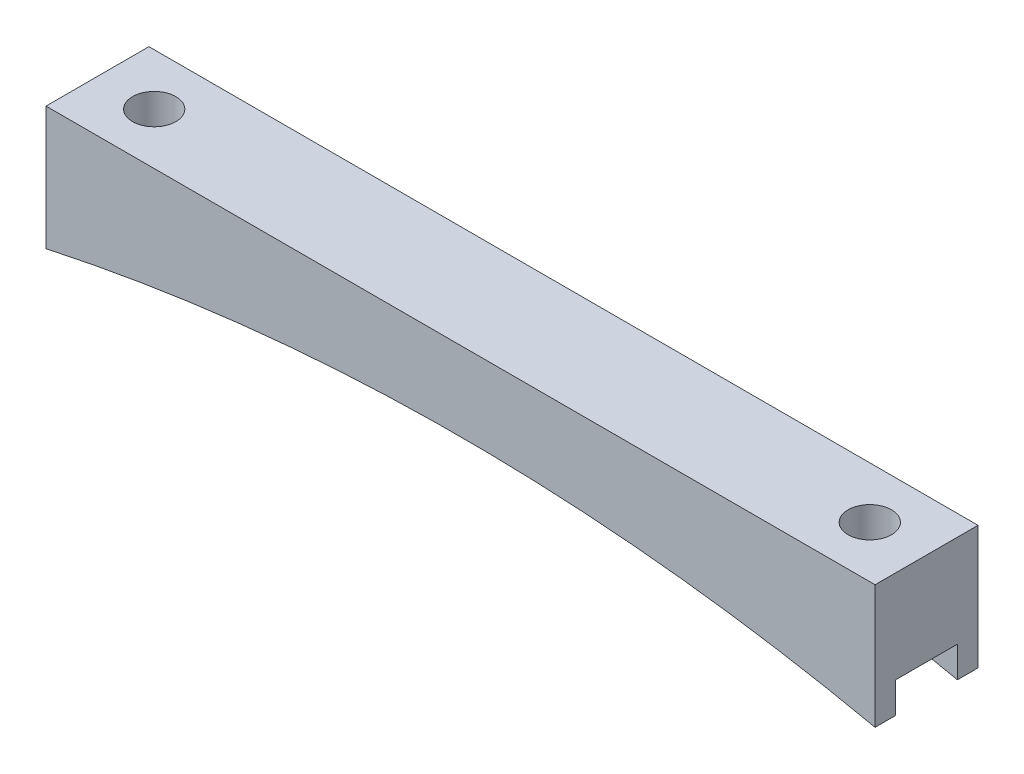
ISO-10303-21;
HEADER;
FILE_DESCRIPTION(('STEP AP214'),'2;1');
FILE_NAME('part.step','',(''),(''),'','','');
FILE_SCHEMA(('AUTOMOTIVE_DESIGN { 1 0 10303 214 1 1 1 1 }'));
ENDSEC;
DATA;
#1=APPLICATION_CONTEXT('core data for automotive mechanical design processes');
#2=APPLICATION_PROTOCOL_DEFINITION('international standard','automotive_design',2000,#1);
#3=PRODUCT_CONTEXT('',#1,'mechanical');
#4=PRODUCT('Part','Part','',(#3));
#5=PRODUCT_RELATED_PRODUCT_CATEGORY('part','',(#4));
#6=PRODUCT_DEFINITION_FORMATION('','',#4);
#7=PRODUCT_DEFINITION_CONTEXT('part definition',#1,'design');
#8=PRODUCT_DEFINITION('design','',#6,#7);
#9=PRODUCT_DEFINITION_SHAPE('','',#8);
#10=(LENGTH_UNIT() NAMED_UNIT(*) SI_UNIT(.MILLI.,.METRE.));
#11=(NAMED_UNIT(*) PLANE_ANGLE_UNIT() SI_UNIT($,.RADIAN.));
#12=(NAMED_UNIT(*) SI_UNIT($,.STERADIAN.) SOLID_ANGLE_UNIT());
#13=UNCERTAINTY_MEASURE_WITH_UNIT(LENGTH_MEASURE(1.E-05),#10,'distance_accuracy_value','');
#14=(GEOMETRIC_REPRESENTATION_CONTEXT(3) GLOBAL_UNCERTAINTY_ASSIGNED_CONTEXT((#13)) GLOBAL_UNIT_ASSIGNED_CONTEXT((#10,
#11,#12)) REPRESENTATION_CONTEXT('',''));
#15=CARTESIAN_POINT('',(0.,0.,0.));
#16=DIRECTION('',(0.,0.,1.));
#17=DIRECTION('',(1.,0.,0.));
#18=AXIS2_PLACEMENT_3D('',#15,#16,#17);
#19=CARTESIAN_POINT('',(51.145,0.,12.7));
#20=DIRECTION('',(-1.,0.,0.));
#21=DIRECTION('',(0.,-1.,0.));
#22=AXIS2_PLACEMENT_3D('',#19,#20,#21);
#23=PLANE('',#22);
#24=DIRECTION('',(0.,0.,-1.));
#25=VECTOR('',#24,1.);
#26=CARTESIAN_POINT('',(51.145,-15.24,12.7));
#27=LINE('',#26,#25);
#28=CARTESIAN_POINT('',(51.145,-15.24,12.7));
#29=VERTEX_POINT('',#28);
#30=CARTESIAN_POINT('',(51.145,-15.24,10.16));
#31=VERTEX_POINT('',#30);
#32=EDGE_CURVE('E156',#29,#31,#27,.T.);
#33=ORIENTED_EDGE('',*,*,#32,.T.);
#34=DIRECTION('',(0.,-1.,0.));
#35=VECTOR('',#34,1.);
#36=CARTESIAN_POINT('',(51.145,-15.24,10.16));
#37=LINE('',#36,#35);
#38=CARTESIAN_POINT('',(51.145,-11.43,10.16));
#39=VERTEX_POINT('',#38);
#40=EDGE_CURVE('E185',#39,#31,#37,.T.);
#41=ORIENTED_EDGE('',*,*,#40,.F.);
#42=DIRECTION('',(0.,0.,1.));
#43=VECTOR('',#42,1.);
#44=CARTESIAN_POINT('',(51.145,-11.43,10.16));
#45=LINE('',#44,#43);
#46=CARTESIAN_POINT('',(51.145,-11.43,2.54));
#47=VERTEX_POINT('',#46);
#48=EDGE_CURVE('E141',#47,#39,#45,.T.);
#49=ORIENTED_EDGE('',*,*,#48,.F.);
#50=DIRECTION('',(0.,1.,0.));
#51=VECTOR('',#50,1.);
#52=CARTESIAN_POINT('',(51.145,-15.24,2.54));
#53=LINE('',#52,#51);
#54=CARTESIAN_POINT('',(51.145,-15.24,2.54));
#55=VERTEX_POINT('',#54);
#56=EDGE_CURVE('E177',#55,#47,#53,.T.);
#57=ORIENTED_EDGE('',*,*,#56,.F.);
#58=CARTESIAN_POINT('',(51.145,-15.24,0.));
#59=VERTEX_POINT('',#58);
#60=EDGE_CURVE('E174',#55,#59,#27,.T.);
#61=ORIENTED_EDGE('',*,*,#60,.T.);
#62=DIRECTION('',(0.,1.,0.));
#63=VECTOR('',#62,1.);
#64=CARTESIAN_POINT('',(51.145,0.,0.));
#65=LINE('',#64,#63);
#66=CARTESIAN_POINT('',(51.145,0.,0.));
#67=VERTEX_POINT('',#66);
#68=EDGE_CURVE('E213',#59,#67,#65,.T.);
#69=ORIENTED_EDGE('',*,*,#68,.T.);
#70=DIRECTION('',(0.,0.,-1.));
#71=VECTOR('',#70,1.);
#72=CARTESIAN_POINT('',(51.145,0.,12.7));
#73=LINE('',#72,#71);
#74=CARTESIAN_POINT('',(51.145,0.,12.7));
#75=VERTEX_POINT('',#74);
#76=EDGE_CURVE('E154',#75,#67,#73,.T.);
#77=ORIENTED_EDGE('',*,*,#76,.F.);
#78=DIRECTION('',(0.,1.,0.));
#79=VECTOR('',#78,1.);
#80=CARTESIAN_POINT('',(51.145,0.,12.7));
#81=LINE('',#80,#79);
#82=EDGE_CURVE('E217',#29,#75,#81,.T.);
#83=ORIENTED_EDGE('',*,*,#82,.F.);
#84=EDGE_LOOP('',(#33,#41,#49,#57,#61,#69,#77,#83));
#85=FACE_BOUND('',#84,.T.);
#86=ADVANCED_FACE('F43',(#85),#23,.F.);
#87=CARTESIAN_POINT('',(-51.145,0.,12.7));
#88=DIRECTION('',(0.,-1.,0.));
#89=DIRECTION('',(1.,0.,0.));
#90=AXIS2_PLACEMENT_3D('',#87,#88,#89);
#91=PLANE('',#90);
#92=CARTESIAN_POINT('',(-44.145,0.,6.35));
#93=DIRECTION('',(0.,1.,0.));
#94=DIRECTION('',(-1.,0.,0.));
#95=AXIS2_PLACEMENT_3D('',#92,#93,#94);
#96=CIRCLE('',#95,2.675);
#97=CARTESIAN_POINT('',(-46.82,0.,6.35));
#98=VERTEX_POINT('',#97);
#99=EDGE_CURVE('E209',#98,#98,#96,.T.);
#100=ORIENTED_EDGE('',*,*,#99,.F.);
#101=EDGE_LOOP('',(#100));
#102=FACE_BOUND('',#101,.T.);
#103=CARTESIAN_POINT('',(44.145,0.,6.35));
#104=DIRECTION('',(0.,1.,0.));
#105=DIRECTION('',(-1.,0.,0.));
#106=AXIS2_PLACEMENT_3D('',#103,#104,#105);
#107=CIRCLE('',#106,2.675);
#108=CARTESIAN_POINT('',(41.47,0.,6.35));
#109=VERTEX_POINT('',#108);
#110=EDGE_CURVE('E208',#109,#109,#107,.T.);
#111=ORIENTED_EDGE('',*,*,#110,.F.);
#112=EDGE_LOOP('',(#111));
#113=FACE_BOUND('',#112,.T.);
#114=DIRECTION('',(-1.,0.,0.));
#115=VECTOR('',#114,1.);
#116=CARTESIAN_POINT('',(-51.145,0.,0.));
#117=LINE('',#116,#115);
#118=CARTESIAN_POINT('',(-51.145,0.,0.));
#119=VERTEX_POINT('',#118);
#120=EDGE_CURVE('E232',#67,#119,#117,.T.);
#121=ORIENTED_EDGE('',*,*,#120,.T.);
#122=DIRECTION('',(0.,0.,-1.));
#123=VECTOR('',#122,1.);
#124=CARTESIAN_POINT('',(-51.145,0.,12.7));
#125=LINE('',#124,#123);
#126=CARTESIAN_POINT('',(-51.145,0.,12.7));
#127=VERTEX_POINT('',#126);
#128=EDGE_CURVE('E148',#127,#119,#125,.T.);
#129=ORIENTED_EDGE('',*,*,#128,.F.);
#130=DIRECTION('',(-1.,0.,0.));
#131=VECTOR('',#130,1.);
#132=CARTESIAN_POINT('',(-51.145,0.,12.7));
#133=LINE('',#132,#131);
#134=EDGE_CURVE('E221',#75,#127,#133,.T.);
#135=ORIENTED_EDGE('',*,*,#134,.F.);
#136=ORIENTED_EDGE('',*,*,#76,.T.);
#137=EDGE_LOOP('',(#121,#129,#135,#136));
#138=FACE_BOUND('',#137,.T.);
#139=ADVANCED_FACE('F247',(#102,#113,#138),#91,.F.);
#140=CARTESIAN_POINT('',(-51.145,0.,12.7));
#141=DIRECTION('',(1.,0.,0.));
#142=DIRECTION('',(0.,1.,0.));
#143=AXIS2_PLACEMENT_3D('',#140,#141,#142);
#144=PLANE('',#143);
#145=DIRECTION('',(0.,0.,1.));
#146=VECTOR('',#145,1.);
#147=CARTESIAN_POINT('',(-51.145,-11.43,10.16));
#148=LINE('',#147,#146);
#149=CARTESIAN_POINT('',(-51.145,-11.43,2.54));
#150=VERTEX_POINT('',#149);
#151=CARTESIAN_POINT('',(-51.145,-11.43,10.16));
#152=VERTEX_POINT('',#151);
#153=EDGE_CURVE('E139',#150,#152,#148,.T.);
#154=ORIENTED_EDGE('',*,*,#153,.T.);
#155=DIRECTION('',(0.,-1.,0.));
#156=VECTOR('',#155,1.);
#157=CARTESIAN_POINT('',(-51.145,-15.24,10.16));
#158=LINE('',#157,#156);
#159=CARTESIAN_POINT('',(-51.145,-15.24,10.16));
#160=VERTEX_POINT('',#159);
#161=EDGE_CURVE('E124',#152,#160,#158,.T.);
#162=ORIENTED_EDGE('',*,*,#161,.T.);
#163=DIRECTION('',(0.,0.,-1.));
#164=VECTOR('',#163,1.);
#165=CARTESIAN_POINT('',(-51.145,-15.24,12.7));
#166=LINE('',#165,#164);
#167=CARTESIAN_POINT('',(-51.145,-15.24,12.7));
#168=VERTEX_POINT('',#167);
#169=EDGE_CURVE('E136',#168,#160,#166,.T.);
#170=ORIENTED_EDGE('',*,*,#169,.F.);
#171=DIRECTION('',(0.,-1.,0.));
#172=VECTOR('',#171,1.);
#173=CARTESIAN_POINT('',(-51.145,0.,12.7));
#174=LINE('',#173,#172);
#175=EDGE_CURVE('E225',#127,#168,#174,.T.);
#176=ORIENTED_EDGE('',*,*,#175,.F.);
#177=ORIENTED_EDGE('',*,*,#128,.T.);
#178=DIRECTION('',(0.,-1.,0.));
#179=VECTOR('',#178,1.);
#180=CARTESIAN_POINT('',(-51.145,0.,0.));
#181=LINE('',#180,#179);
#182=CARTESIAN_POINT('',(-51.145,-15.24,0.));
#183=VERTEX_POINT('',#182);
#184=EDGE_CURVE('E235',#119,#183,#181,.T.);
#185=ORIENTED_EDGE('',*,*,#184,.T.);
#186=CARTESIAN_POINT('',(-51.145,-15.24,2.54));
#187=VERTEX_POINT('',#186);
#188=EDGE_CURVE('E149',#187,#183,#166,.T.);
#189=ORIENTED_EDGE('',*,*,#188,.F.);
#190=DIRECTION('',(0.,1.,0.));
#191=VECTOR('',#190,1.);
#192=CARTESIAN_POINT('',(-51.145,-15.24,2.54));
#193=LINE('',#192,#191);
#194=EDGE_CURVE('E67',#187,#150,#193,.T.);
#195=ORIENTED_EDGE('',*,*,#194,.T.);
#196=EDGE_LOOP('',(#154,#162,#170,#176,#177,#185,#189,#195));
#197=FACE_BOUND('',#196,.T.);
#198=ADVANCED_FACE('F134',(#197),#144,.F.);
#199=CARTESIAN_POINT('',(0.,-251.057469613682,12.7));
#200=DIRECTION('',(0.,0.,-1.));
#201=DIRECTION('',(-1.,0.,0.));
#202=AXIS2_PLACEMENT_3D('',#199,#200,#201);
#203=CYLINDRICAL_SURFACE('',#202,241.3);
#204=DIRECTION('',(0.,0.,-1.));
#205=VECTOR('',#204,1.);
#206=CARTESIAN_POINT('',(28.361343525012,-11.43,12.7));
#207=LINE('',#206,#205);
#208=CARTESIAN_POINT('',(28.361343525012,-11.43,2.54));
#209=VERTEX_POINT('',#208);
#210=CARTESIAN_POINT('',(28.3613435250121,-11.43,10.16));
#211=VERTEX_POINT('',#210);
#212=EDGE_CURVE('E172',#209,#211,#207,.F.);
#213=ORIENTED_EDGE('',*,*,#212,.T.);
#214=CARTESIAN_POINT('',(0.,-251.057469613682,10.16));
#215=DIRECTION('',(0.,0.,1.));
#216=DIRECTION('',(1.,0.,0.));
#217=AXIS2_PLACEMENT_3D('',#214,#215,#216);
#218=CIRCLE('',#217,241.3);
#219=EDGE_CURVE('E11',#211,#31,#218,.F.);
#220=ORIENTED_EDGE('',*,*,#219,.T.);
#221=ORIENTED_EDGE('',*,*,#32,.F.);
#222=CARTESIAN_POINT('',(0.,-251.057469613682,12.7));
#223=DIRECTION('',(0.,0.,-1.));
#224=DIRECTION('',(-1.,0.,0.));
#225=AXIS2_PLACEMENT_3D('',#222,#223,#224);
#226=CIRCLE('',#225,241.3);
#227=EDGE_CURVE('E146',#168,#29,#226,.T.);
#228=ORIENTED_EDGE('',*,*,#227,.F.);
#229=ORIENTED_EDGE('',*,*,#169,.T.);
#230=CARTESIAN_POINT('',(-28.361343525012,-11.43,10.16));
#231=VERTEX_POINT('',#230);
#232=EDGE_CURVE('E46',#160,#231,#218,.F.);
#233=ORIENTED_EDGE('',*,*,#232,.T.);
#234=DIRECTION('',(0.,0.,-1.));
#235=VECTOR('',#234,1.);
#236=CARTESIAN_POINT('',(-28.361343525012,-11.43,12.7));
#237=LINE('',#236,#235);
#238=CARTESIAN_POINT('',(-28.361343525012,-11.43,2.54));
#239=VERTEX_POINT('',#238);
#240=EDGE_CURVE('E203',#231,#239,#237,.T.);
#241=ORIENTED_EDGE('',*,*,#240,.T.);
#242=CARTESIAN_POINT('',(0.,-251.057469613682,2.54));
#243=DIRECTION('',(0.,0.,-1.));
#244=DIRECTION('',(-1.,0.,0.));
#245=AXIS2_PLACEMENT_3D('',#242,#243,#244);
#246=CIRCLE('',#245,241.3);
#247=EDGE_CURVE('E131',#239,#187,#246,.F.);
#248=ORIENTED_EDGE('',*,*,#247,.T.);
#249=ORIENTED_EDGE('',*,*,#188,.T.);
#250=CARTESIAN_POINT('',(0.,-251.057469613682,0.));
#251=DIRECTION('',(0.,0.,-1.));
#252=DIRECTION('',(-1.,0.,0.));
#253=AXIS2_PLACEMENT_3D('',#250,#251,#252);
#254=CIRCLE('',#253,241.3);
#255=EDGE_CURVE('E222',#183,#59,#254,.T.);
#256=ORIENTED_EDGE('',*,*,#255,.T.);
#257=ORIENTED_EDGE('',*,*,#60,.F.);
#258=EDGE_CURVE('E52',#55,#209,#246,.F.);
#259=ORIENTED_EDGE('',*,*,#258,.T.);
#260=EDGE_LOOP('',(#213,#220,#221,#228,#229,#233,#241,#248,#249,#256,#257,#259));
#261=FACE_BOUND('',#260,.T.);
#262=ADVANCED_FACE('F144',(#261),#203,.F.);
#263=CARTESIAN_POINT('',(0.,-251.057469613682,12.7));
#264=DIRECTION('',(0.,0.,-1.));
#265=DIRECTION('',(-1.,0.,0.));
#266=AXIS2_PLACEMENT_3D('',#263,#264,#265);
#267=PLANE('',#266);
#268=ORIENTED_EDGE('',*,*,#82,.T.);
#269=ORIENTED_EDGE('',*,*,#134,.T.);
#270=ORIENTED_EDGE('',*,*,#175,.T.);
#271=ORIENTED_EDGE('',*,*,#227,.T.);
#272=EDGE_LOOP('',(#268,#269,#270,#271));
#273=FACE_BOUND('',#272,.T.);
#274=ADVANCED_FACE('F250',(#273),#267,.F.);
#275=CARTESIAN_POINT('',(0.,-251.057469613682,0.));
#276=DIRECTION('',(0.,0.,-1.));
#277=DIRECTION('',(-1.,0.,0.));
#278=AXIS2_PLACEMENT_3D('',#275,#276,#277);
#279=PLANE('',#278);
#280=ORIENTED_EDGE('',*,*,#68,.F.);
#281=ORIENTED_EDGE('',*,*,#255,.F.);
#282=ORIENTED_EDGE('',*,*,#184,.F.);
#283=ORIENTED_EDGE('',*,*,#120,.F.);
#284=EDGE_LOOP('',(#280,#281,#282,#283));
#285=FACE_BOUND('',#284,.T.);
#286=ADVANCED_FACE('F243',(#285),#279,.T.);
#287=CARTESIAN_POINT('',(44.145,-15.24,6.35));
#288=DIRECTION('',(0.,1.,0.));
#289=DIRECTION('',(-1.,0.,0.));
#290=AXIS2_PLACEMENT_3D('',#287,#288,#289);
#291=CYLINDRICAL_SURFACE('',#290,2.675);
#292=CARTESIAN_POINT('',(44.145,-11.43,6.35));
#293=DIRECTION('',(0.,1.,0.));
#294=DIRECTION('',(0.,0.,1.));
#295=AXIS2_PLACEMENT_3D('',#292,#293,#294);
#296=CIRCLE('',#295,2.675);
#297=CARTESIAN_POINT('',(44.145,-11.43,9.025));
#298=VERTEX_POINT('',#297);
#299=EDGE_CURVE('E166',#298,#298,#296,.F.);
#300=ORIENTED_EDGE('',*,*,#299,.T.);
#301=EDGE_LOOP('',(#300));
#302=FACE_BOUND('',#301,.T.);
#303=ORIENTED_EDGE('',*,*,#110,.T.);
#304=EDGE_LOOP('',(#303));
#305=FACE_BOUND('',#304,.T.);
#306=ADVANCED_FACE('F292',(#302,#305),#291,.F.);
#307=CARTESIAN_POINT('',(-44.145,-15.24,6.35));
#308=DIRECTION('',(0.,1.,0.));
#309=DIRECTION('',(-1.,0.,0.));
#310=AXIS2_PLACEMENT_3D('',#307,#308,#309);
#311=CYLINDRICAL_SURFACE('',#310,2.675);
#312=CARTESIAN_POINT('',(-44.145,-11.43,6.35));
#313=DIRECTION('',(0.,1.,0.));
#314=DIRECTION('',(0.,0.,1.));
#315=AXIS2_PLACEMENT_3D('',#312,#313,#314);
#316=CIRCLE('',#315,2.675);
#317=CARTESIAN_POINT('',(-44.145,-11.43,9.025));
#318=VERTEX_POINT('',#317);
#319=EDGE_CURVE('E163',#318,#318,#316,.F.);
#320=ORIENTED_EDGE('',*,*,#319,.T.);
#321=EDGE_LOOP('',(#320));
#322=FACE_BOUND('',#321,.T.);
#323=ORIENTED_EDGE('',*,*,#99,.T.);
#324=EDGE_LOOP('',(#323));
#325=FACE_BOUND('',#324,.T.);
#326=ADVANCED_FACE('F274',(#322,#325),#311,.F.);
#327=CARTESIAN_POINT('',(-51.145,-11.43,10.16));
#328=DIRECTION('',(0.,1.,0.));
#329=DIRECTION('',(0.,0.,1.));
#330=AXIS2_PLACEMENT_3D('',#327,#328,#329);
#331=PLANE('',#330);
#332=ORIENTED_EDGE('',*,*,#319,.F.);
#333=EDGE_LOOP('',(#332));
#334=FACE_BOUND('',#333,.T.);
#335=DIRECTION('',(1.,0.,0.));
#336=VECTOR('',#335,1.);
#337=CARTESIAN_POINT('',(-51.145,-11.43,10.16));
#338=LINE('',#337,#336);
#339=EDGE_CURVE('E126',#152,#231,#338,.T.);
#340=ORIENTED_EDGE('',*,*,#339,.F.);
#341=ORIENTED_EDGE('',*,*,#153,.F.);
#342=DIRECTION('',(1.,0.,0.));
#343=VECTOR('',#342,1.);
#344=CARTESIAN_POINT('',(-51.145,-11.43,2.54));
#345=LINE('',#344,#343);
#346=EDGE_CURVE('E196',#150,#239,#345,.T.);
#347=ORIENTED_EDGE('',*,*,#346,.T.);
#348=ORIENTED_EDGE('',*,*,#240,.F.);
#349=EDGE_LOOP('',(#340,#341,#347,#348));
#350=FACE_BOUND('',#349,.T.);
#351=ADVANCED_FACE('F266',(#334,#350),#331,.F.);
#352=CARTESIAN_POINT('',(-51.145,-15.24,2.54));
#353=DIRECTION('',(0.,0.,-1.));
#354=DIRECTION('',(-1.,0.,0.));
#355=AXIS2_PLACEMENT_3D('',#352,#353,#354);
#356=PLANE('',#355);
#357=ORIENTED_EDGE('',*,*,#346,.F.);
#358=ORIENTED_EDGE('',*,*,#194,.F.);
#359=ORIENTED_EDGE('',*,*,#247,.F.);
#360=EDGE_LOOP('',(#357,#358,#359));
#361=FACE_BOUND('',#360,.T.);
#362=ADVANCED_FACE('F271',(#361),#356,.F.);
#363=CARTESIAN_POINT('',(-51.145,-15.24,10.16));
#364=DIRECTION('',(0.,0.,1.));
#365=DIRECTION('',(1.,0.,0.));
#366=AXIS2_PLACEMENT_3D('',#363,#364,#365);
#367=PLANE('',#366);
#368=ORIENTED_EDGE('',*,*,#161,.F.);
#369=ORIENTED_EDGE('',*,*,#339,.T.);
#370=ORIENTED_EDGE('',*,*,#232,.F.);
#371=EDGE_LOOP('',(#368,#369,#370));
#372=FACE_BOUND('',#371,.T.);
#373=ADVANCED_FACE('F123',(#372),#367,.F.);
#374=EDGE_CURVE('E195',#211,#39,#338,.T.);
#375=ORIENTED_EDGE('',*,*,#374,.T.);
#376=ORIENTED_EDGE('',*,*,#40,.T.);
#377=ORIENTED_EDGE('',*,*,#219,.F.);
#378=EDGE_LOOP('',(#375,#376,#377));
#379=FACE_BOUND('',#378,.T.);
#380=ADVANCED_FACE('F254',(#379),#367,.F.);
#381=ORIENTED_EDGE('',*,*,#56,.T.);
#382=EDGE_CURVE('E59',#209,#47,#345,.T.);
#383=ORIENTED_EDGE('',*,*,#382,.F.);
#384=ORIENTED_EDGE('',*,*,#258,.F.);
#385=EDGE_LOOP('',(#381,#383,#384));
#386=FACE_BOUND('',#385,.T.);
#387=ADVANCED_FACE('F176',(#386),#356,.F.);
#388=ORIENTED_EDGE('',*,*,#299,.F.);
#389=EDGE_LOOP('',(#388));
#390=FACE_BOUND('',#389,.T.);
#391=ORIENTED_EDGE('',*,*,#382,.T.);
#392=ORIENTED_EDGE('',*,*,#48,.T.);
#393=ORIENTED_EDGE('',*,*,#374,.F.);
#394=ORIENTED_EDGE('',*,*,#212,.F.);
#395=EDGE_LOOP('',(#391,#392,#393,#394));
#396=FACE_BOUND('',#395,.T.);
#397=ADVANCED_FACE('F258',(#390,#396),#331,.F.);
#398=CLOSED_SHELL('',(#86,#139,#198,#262,#274,#286,#306,#326,#351,#362,#373,#380,#387,#397));
#399=MANIFOLD_SOLID_BREP('B2',#398);
#400=ADVANCED_BREP_SHAPE_REPRESENTATION('',(#18,#399),#14);
#401=SHAPE_DEFINITION_REPRESENTATION(#9,#400);
ENDSEC;
END-ISO-10303-21;
